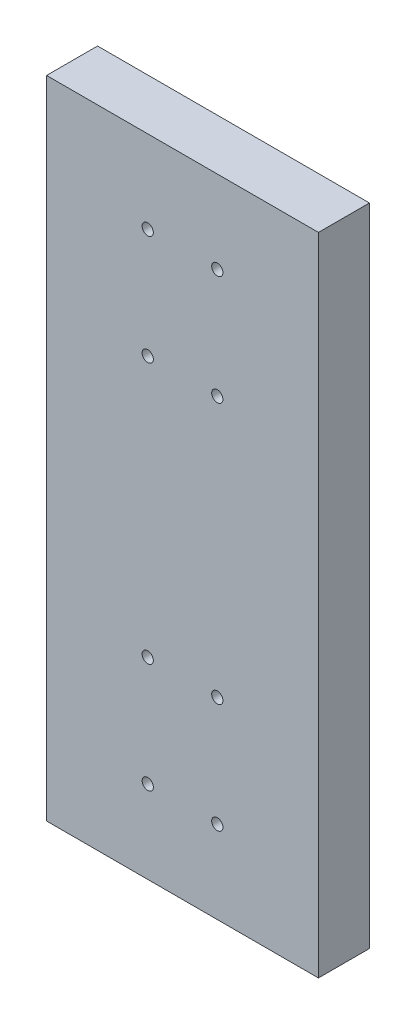
ISO-10303-21;
HEADER;
FILE_DESCRIPTION(('STEP AP214'),'2;1');
FILE_NAME('part.step','',(''),(''),'','','');
FILE_SCHEMA(('AUTOMOTIVE_DESIGN { 1 0 10303 214 1 1 1 1 }'));
ENDSEC;
DATA;
#1=APPLICATION_CONTEXT('core data for automotive mechanical design processes');
#2=APPLICATION_PROTOCOL_DEFINITION('international standard','automotive_design',2000,#1);
#3=PRODUCT_CONTEXT('',#1,'mechanical');
#4=PRODUCT('Part','Part','',(#3));
#5=PRODUCT_RELATED_PRODUCT_CATEGORY('part','',(#4));
#6=PRODUCT_DEFINITION_FORMATION('','',#4);
#7=PRODUCT_DEFINITION_CONTEXT('part definition',#1,'design');
#8=PRODUCT_DEFINITION('design','',#6,#7);
#9=PRODUCT_DEFINITION_SHAPE('','',#8);
#10=(LENGTH_UNIT() NAMED_UNIT(*) SI_UNIT(.MILLI.,.METRE.));
#11=(NAMED_UNIT(*) PLANE_ANGLE_UNIT() SI_UNIT($,.RADIAN.));
#12=(NAMED_UNIT(*) SI_UNIT($,.STERADIAN.) SOLID_ANGLE_UNIT());
#13=UNCERTAINTY_MEASURE_WITH_UNIT(LENGTH_MEASURE(1.E-05),#10,'distance_accuracy_value','');
#14=(GEOMETRIC_REPRESENTATION_CONTEXT(3) GLOBAL_UNCERTAINTY_ASSIGNED_CONTEXT((#13)) GLOBAL_UNIT_ASSIGNED_CONTEXT((#10,
#11,#12)) REPRESENTATION_CONTEXT('',''));
#15=CARTESIAN_POINT('',(0.,0.,0.));
#16=DIRECTION('',(0.,0.,1.));
#17=DIRECTION('',(1.,0.,0.));
#18=AXIS2_PLACEMENT_3D('',#15,#16,#17);
#19=CARTESIAN_POINT('',(-421.424489340462,4984.89555917853,19.0499999999997));
#20=DIRECTION('',(1.,0.,0.));
#21=DIRECTION('',(0.,1.,0.));
#22=AXIS2_PLACEMENT_3D('',#19,#20,#21);
#23=PLANE('',#22);
#24=DIRECTION('',(0.,-1.,0.));
#25=VECTOR('',#24,1.);
#26=CARTESIAN_POINT('',(-421.424489340462,4984.89555917853,-2.77555756156289E-13));
#27=LINE('',#26,#25);
#28=CARTESIAN_POINT('',(-421.424489340462,4984.89555917853,-2.77555756156289E-13));
#29=VERTEX_POINT('',#28);
#30=CARTESIAN_POINT('',(-421.424489340462,4743.59555917853,-2.77555756156289E-13));
#31=VERTEX_POINT('',#30);
#32=EDGE_CURVE('E167',#29,#31,#27,.T.);
#33=ORIENTED_EDGE('',*,*,#32,.T.);
#34=DIRECTION('',(0.,0.,-1.));
#35=VECTOR('',#34,1.);
#36=CARTESIAN_POINT('',(-421.424489340462,4743.59555917853,19.0499999999997));
#37=LINE('',#36,#35);
#38=CARTESIAN_POINT('',(-421.424489340462,4743.59555917853,19.0499999999997));
#39=VERTEX_POINT('',#38);
#40=EDGE_CURVE('E11',#39,#31,#37,.T.);
#41=ORIENTED_EDGE('',*,*,#40,.F.);
#42=DIRECTION('',(0.,-1.,0.));
#43=VECTOR('',#42,1.);
#44=CARTESIAN_POINT('',(-421.424489340462,4984.89555917853,19.0499999999997));
#45=LINE('',#44,#43);
#46=CARTESIAN_POINT('',(-421.424489340462,4984.89555917853,19.0499999999997));
#47=VERTEX_POINT('',#46);
#48=EDGE_CURVE('E168',#47,#39,#45,.T.);
#49=ORIENTED_EDGE('',*,*,#48,.F.);
#50=DIRECTION('',(0.,0.,-1.));
#51=VECTOR('',#50,1.);
#52=CARTESIAN_POINT('',(-421.424489340462,4984.89555917853,19.0499999999997));
#53=LINE('',#52,#51);
#54=EDGE_CURVE('E174',#47,#29,#53,.T.);
#55=ORIENTED_EDGE('',*,*,#54,.T.);
#56=EDGE_LOOP('',(#33,#41,#49,#55));
#57=FACE_BOUND('',#56,.T.);
#58=ADVANCED_FACE('F38',(#57),#23,.F.);
#59=CARTESIAN_POINT('',(-421.424489340462,4743.59555917853,19.0499999999997));
#60=DIRECTION('',(0.,1.,0.));
#61=DIRECTION('',(0.,0.,1.));
#62=AXIS2_PLACEMENT_3D('',#59,#60,#61);
#63=PLANE('',#62);
#64=DIRECTION('',(1.,0.,0.));
#65=VECTOR('',#64,1.);
#66=CARTESIAN_POINT('',(-421.424489340462,4743.59555917853,-2.77555756156289E-13));
#67=LINE('',#66,#65);
#68=CARTESIAN_POINT('',(-319.824489340462,4743.59555917853,-2.77555756156289E-13));
#69=VERTEX_POINT('',#68);
#70=EDGE_CURVE('E177',#31,#69,#67,.T.);
#71=ORIENTED_EDGE('',*,*,#70,.T.);
#72=DIRECTION('',(0.,0.,-1.));
#73=VECTOR('',#72,1.);
#74=CARTESIAN_POINT('',(-319.824489340462,4743.59555917853,19.0499999999997));
#75=LINE('',#74,#73);
#76=CARTESIAN_POINT('',(-319.824489340462,4743.59555917853,19.0499999999997));
#77=VERTEX_POINT('',#76);
#78=EDGE_CURVE('E46',#77,#69,#75,.T.);
#79=ORIENTED_EDGE('',*,*,#78,.F.);
#80=DIRECTION('',(1.,0.,0.));
#81=VECTOR('',#80,1.);
#82=CARTESIAN_POINT('',(-421.424489340462,4743.59555917853,19.0499999999997));
#83=LINE('',#82,#81);
#84=EDGE_CURVE('E85',#39,#77,#83,.T.);
#85=ORIENTED_EDGE('',*,*,#84,.F.);
#86=ORIENTED_EDGE('',*,*,#40,.T.);
#87=EDGE_LOOP('',(#71,#79,#85,#86));
#88=FACE_BOUND('',#87,.T.);
#89=ADVANCED_FACE('F201',(#88),#63,.F.);
#90=CARTESIAN_POINT('',(-319.824489340462,4984.89555917853,19.0499999999997));
#91=DIRECTION('',(-1.,0.,0.));
#92=DIRECTION('',(0.,0.,1.));
#93=AXIS2_PLACEMENT_3D('',#90,#91,#92);
#94=PLANE('',#93);
#95=DIRECTION('',(0.,1.,0.));
#96=VECTOR('',#95,1.);
#97=CARTESIAN_POINT('',(-319.824489340462,4984.89555917853,-2.77555756156289E-13));
#98=LINE('',#97,#96);
#99=CARTESIAN_POINT('',(-319.824489340462,4984.89555917853,-2.77555756156289E-13));
#100=VERTEX_POINT('',#99);
#101=EDGE_CURVE('E72',#69,#100,#98,.T.);
#102=ORIENTED_EDGE('',*,*,#101,.T.);
#103=DIRECTION('',(0.,0.,-1.));
#104=VECTOR('',#103,1.);
#105=CARTESIAN_POINT('',(-319.824489340462,4984.89555917853,19.0499999999997));
#106=LINE('',#105,#104);
#107=CARTESIAN_POINT('',(-319.824489340462,4984.89555917853,19.0499999999997));
#108=VERTEX_POINT('',#107);
#109=EDGE_CURVE('E182',#108,#100,#106,.T.);
#110=ORIENTED_EDGE('',*,*,#109,.F.);
#111=DIRECTION('',(0.,1.,0.));
#112=VECTOR('',#111,1.);
#113=CARTESIAN_POINT('',(-319.824489340462,4984.89555917853,19.0499999999997));
#114=LINE('',#113,#112);
#115=EDGE_CURVE('E171',#77,#108,#114,.T.);
#116=ORIENTED_EDGE('',*,*,#115,.F.);
#117=ORIENTED_EDGE('',*,*,#78,.T.);
#118=EDGE_LOOP('',(#102,#110,#116,#117));
#119=FACE_BOUND('',#118,.T.);
#120=ADVANCED_FACE('F184',(#119),#94,.F.);
#121=CARTESIAN_POINT('',(-421.424489340462,4984.89555917853,19.0499999999997));
#122=DIRECTION('',(0.,-1.,0.));
#123=DIRECTION('',(0.,0.,-1.));
#124=AXIS2_PLACEMENT_3D('',#121,#122,#123);
#125=PLANE('',#124);
#126=DIRECTION('',(-1.,0.,0.));
#127=VECTOR('',#126,1.);
#128=CARTESIAN_POINT('',(-421.424489340462,4984.89555917853,-2.77555756156289E-13));
#129=LINE('',#128,#127);
#130=EDGE_CURVE('E78',#100,#29,#129,.T.);
#131=ORIENTED_EDGE('',*,*,#130,.T.);
#132=ORIENTED_EDGE('',*,*,#54,.F.);
#133=DIRECTION('',(-1.,0.,0.));
#134=VECTOR('',#133,1.);
#135=CARTESIAN_POINT('',(-421.424489340462,4984.89555917853,19.0499999999997));
#136=LINE('',#135,#134);
#137=EDGE_CURVE('E54',#108,#47,#136,.T.);
#138=ORIENTED_EDGE('',*,*,#137,.F.);
#139=ORIENTED_EDGE('',*,*,#109,.T.);
#140=EDGE_LOOP('',(#131,#132,#138,#139));
#141=FACE_BOUND('',#140,.T.);
#142=ADVANCED_FACE('F191',(#141),#125,.F.);
#143=CARTESIAN_POINT('',(0.,0.,19.0499999999997));
#144=DIRECTION('',(0.,0.,1.));
#145=DIRECTION('',(1.,0.,0.));
#146=AXIS2_PLACEMENT_3D('',#143,#144,#145);
#147=PLANE('',#146);
#148=CARTESIAN_POINT('',(-383.624489340462,4912.99555917853,19.0499999999996));
#149=DIRECTION('',(0.,0.,1.));
#150=DIRECTION('',(0.,-1.,0.));
#151=AXIS2_PLACEMENT_3D('',#148,#149,#150);
#152=CIRCLE('',#151,2.09999999999999);
#153=CARTESIAN_POINT('',(-383.624489340462,4910.89555917853,19.0499999999996));
#154=VERTEX_POINT('',#153);
#155=EDGE_CURVE('E121',#154,#154,#152,.T.);
#156=ORIENTED_EDGE('',*,*,#155,.F.);
#157=EDGE_LOOP('',(#156));
#158=FACE_BOUND('',#157,.T.);
#159=CARTESIAN_POINT('',(-357.624489340539,4912.99555917853,19.0499999999996));
#160=DIRECTION('',(0.,0.,1.));
#161=DIRECTION('',(0.,-1.,0.));
#162=AXIS2_PLACEMENT_3D('',#159,#160,#161);
#163=CIRCLE('',#162,2.09999999999999);
#164=CARTESIAN_POINT('',(-357.624489340539,4910.89555917853,19.0499999999996));
#165=VERTEX_POINT('',#164);
#166=EDGE_CURVE('E120',#165,#165,#163,.T.);
#167=ORIENTED_EDGE('',*,*,#166,.F.);
#168=EDGE_LOOP('',(#167));
#169=FACE_BOUND('',#168,.T.);
#170=CARTESIAN_POINT('',(-357.624489340462,4953.99555917853,19.0499999999996));
#171=DIRECTION('',(0.,0.,1.));
#172=DIRECTION('',(0.,-1.,0.));
#173=AXIS2_PLACEMENT_3D('',#170,#171,#172);
#174=CIRCLE('',#173,2.09999999999999);
#175=CARTESIAN_POINT('',(-357.624489340462,4951.89555917853,19.0499999999996));
#176=VERTEX_POINT('',#175);
#177=EDGE_CURVE('E131',#176,#176,#174,.T.);
#178=ORIENTED_EDGE('',*,*,#177,.F.);
#179=EDGE_LOOP('',(#178));
#180=FACE_BOUND('',#179,.T.);
#181=CARTESIAN_POINT('',(-383.624489340462,4953.99555917853,19.0499999999996));
#182=DIRECTION('',(0.,0.,1.));
#183=DIRECTION('',(0.,-1.,0.));
#184=AXIS2_PLACEMENT_3D('',#181,#182,#183);
#185=CIRCLE('',#184,2.09999999999999);
#186=CARTESIAN_POINT('',(-383.624489340462,4951.89555917853,19.0499999999996));
#187=VERTEX_POINT('',#186);
#188=EDGE_CURVE('E137',#187,#187,#185,.T.);
#189=ORIENTED_EDGE('',*,*,#188,.F.);
#190=EDGE_LOOP('',(#189));
#191=FACE_BOUND('',#190,.T.);
#192=CARTESIAN_POINT('',(-383.62448934054,4774.49555917867,19.0499999999996));
#193=DIRECTION('',(0.,0.,1.));
#194=DIRECTION('',(0.,-1.,0.));
#195=AXIS2_PLACEMENT_3D('',#192,#193,#194);
#196=CIRCLE('',#195,2.09999999999999);
#197=CARTESIAN_POINT('',(-383.62448934054,4772.39555917867,19.0499999999996));
#198=VERTEX_POINT('',#197);
#199=EDGE_CURVE('E143',#198,#198,#196,.T.);
#200=ORIENTED_EDGE('',*,*,#199,.F.);
#201=EDGE_LOOP('',(#200));
#202=FACE_BOUND('',#201,.T.);
#203=CARTESIAN_POINT('',(-383.62448934054,4815.49555917868,19.0499999999996));
#204=DIRECTION('',(0.,0.,1.));
#205=DIRECTION('',(0.,-1.,0.));
#206=AXIS2_PLACEMENT_3D('',#203,#204,#205);
#207=CIRCLE('',#206,2.09999999999999);
#208=CARTESIAN_POINT('',(-383.62448934054,4813.39555917867,19.0499999999996));
#209=VERTEX_POINT('',#208);
#210=EDGE_CURVE('E149',#209,#209,#207,.T.);
#211=ORIENTED_EDGE('',*,*,#210,.F.);
#212=EDGE_LOOP('',(#211));
#213=FACE_BOUND('',#212,.T.);
#214=CARTESIAN_POINT('',(-357.62448934054,4815.49555917867,19.0499999999996));
#215=DIRECTION('',(0.,0.,1.));
#216=DIRECTION('',(0.,-1.,0.));
#217=AXIS2_PLACEMENT_3D('',#214,#215,#216);
#218=CIRCLE('',#217,2.09999999999999);
#219=CARTESIAN_POINT('',(-357.62448934054,4813.39555917867,19.0499999999996));
#220=VERTEX_POINT('',#219);
#221=EDGE_CURVE('E155',#220,#220,#218,.T.);
#222=ORIENTED_EDGE('',*,*,#221,.F.);
#223=EDGE_LOOP('',(#222));
#224=FACE_BOUND('',#223,.T.);
#225=CARTESIAN_POINT('',(-357.624489340462,4774.49555917863,19.0499999999996));
#226=DIRECTION('',(0.,0.,1.));
#227=DIRECTION('',(0.,-1.,0.));
#228=AXIS2_PLACEMENT_3D('',#225,#226,#227);
#229=CIRCLE('',#228,2.09999999999999);
#230=CARTESIAN_POINT('',(-357.624489340462,4772.39555917863,19.0499999999996));
#231=VERTEX_POINT('',#230);
#232=EDGE_CURVE('E161',#231,#231,#229,.T.);
#233=ORIENTED_EDGE('',*,*,#232,.F.);
#234=EDGE_LOOP('',(#233));
#235=FACE_BOUND('',#234,.T.);
#236=ORIENTED_EDGE('',*,*,#48,.T.);
#237=ORIENTED_EDGE('',*,*,#84,.T.);
#238=ORIENTED_EDGE('',*,*,#115,.T.);
#239=ORIENTED_EDGE('',*,*,#137,.T.);
#240=EDGE_LOOP('',(#236,#237,#238,#239));
#241=FACE_BOUND('',#240,.T.);
#242=ADVANCED_FACE('F193',(#158,#169,#180,#191,#202,#213,#224,#235,#241),#147,.T.);
#243=CARTESIAN_POINT('',(0.,0.,-2.77555756156289E-13));
#244=DIRECTION('',(0.,0.,1.));
#245=DIRECTION('',(1.,0.,0.));
#246=AXIS2_PLACEMENT_3D('',#243,#244,#245);
#247=PLANE('',#246);
#248=ORIENTED_EDGE('',*,*,#32,.F.);
#249=ORIENTED_EDGE('',*,*,#130,.F.);
#250=ORIENTED_EDGE('',*,*,#101,.F.);
#251=ORIENTED_EDGE('',*,*,#70,.F.);
#252=EDGE_LOOP('',(#248,#249,#250,#251));
#253=FACE_BOUND('',#252,.T.);
#254=ADVANCED_FACE('F187',(#253),#247,.F.);
#255=CARTESIAN_POINT('',(-357.624489340462,4774.49555917863,7.64999739999959));
#256=DIRECTION('',(0.,0.,1.));
#257=DIRECTION('',(0.,-1.,0.));
#258=AXIS2_PLACEMENT_3D('',#255,#256,#257);
#259=CONICAL_SURFACE('',#258,2.09999999999999,1.02974425867665);
#260=CARTESIAN_POINT('',(-357.624489340462,4774.49555917863,6.38819010004171));
#261=VERTEX_POINT('',#260);
#262=VERTEX_LOOP('',#261);
#263=FACE_BOUND('',#262,.T.);
#264=CARTESIAN_POINT('',(-357.624489340462,4774.49555917863,7.64999739999959));
#265=DIRECTION('',(0.,0.,1.));
#266=DIRECTION('',(0.,-1.,0.));
#267=AXIS2_PLACEMENT_3D('',#264,#265,#266);
#268=CIRCLE('',#267,2.09999999999999);
#269=CARTESIAN_POINT('',(-357.624489340462,4772.39555917863,7.64999739999959));
#270=VERTEX_POINT('',#269);
#271=EDGE_CURVE('E164',#270,#270,#268,.T.);
#272=ORIENTED_EDGE('',*,*,#271,.T.);
#273=EDGE_LOOP('',(#272));
#274=FACE_BOUND('',#273,.T.);
#275=ADVANCED_FACE('F228',(#263,#274),#259,.F.);
#276=CARTESIAN_POINT('',(-357.624489340462,4774.49555917863,19.0499999999996));
#277=DIRECTION('',(0.,0.,1.));
#278=DIRECTION('',(0.,-1.,0.));
#279=AXIS2_PLACEMENT_3D('',#276,#277,#278);
#280=CYLINDRICAL_SURFACE('',#279,2.09999999999999);
#281=ORIENTED_EDGE('',*,*,#271,.F.);
#282=EDGE_LOOP('',(#281));
#283=FACE_BOUND('',#282,.T.);
#284=ORIENTED_EDGE('',*,*,#232,.T.);
#285=EDGE_LOOP('',(#284));
#286=FACE_BOUND('',#285,.T.);
#287=ADVANCED_FACE('F241',(#283,#286),#280,.F.);
#288=CARTESIAN_POINT('',(-357.62448934054,4815.49555917867,7.64999739999959));
#289=DIRECTION('',(0.,0.,1.));
#290=DIRECTION('',(0.,-1.,0.));
#291=AXIS2_PLACEMENT_3D('',#288,#289,#290);
#292=CONICAL_SURFACE('',#291,2.09999999999999,1.02974425867665);
#293=CARTESIAN_POINT('',(-357.62448934054,4815.49555917867,6.38819010004171));
#294=VERTEX_POINT('',#293);
#295=VERTEX_LOOP('',#294);
#296=FACE_BOUND('',#295,.T.);
#297=CARTESIAN_POINT('',(-357.62448934054,4815.49555917867,7.64999739999959));
#298=DIRECTION('',(0.,0.,1.));
#299=DIRECTION('',(0.,-1.,0.));
#300=AXIS2_PLACEMENT_3D('',#297,#298,#299);
#301=CIRCLE('',#300,2.09999999999999);
#302=CARTESIAN_POINT('',(-357.62448934054,4813.39555917867,7.64999739999959));
#303=VERTEX_POINT('',#302);
#304=EDGE_CURVE('E158',#303,#303,#301,.T.);
#305=ORIENTED_EDGE('',*,*,#304,.T.);
#306=EDGE_LOOP('',(#305));
#307=FACE_BOUND('',#306,.T.);
#308=ADVANCED_FACE('F251',(#296,#307),#292,.F.);
#309=CARTESIAN_POINT('',(-357.62448934054,4815.49555917867,19.0499999999996));
#310=DIRECTION('',(0.,0.,1.));
#311=DIRECTION('',(0.,-1.,0.));
#312=AXIS2_PLACEMENT_3D('',#309,#310,#311);
#313=CYLINDRICAL_SURFACE('',#312,2.09999999999999);
#314=ORIENTED_EDGE('',*,*,#304,.F.);
#315=EDGE_LOOP('',(#314));
#316=FACE_BOUND('',#315,.T.);
#317=ORIENTED_EDGE('',*,*,#221,.T.);
#318=EDGE_LOOP('',(#317));
#319=FACE_BOUND('',#318,.T.);
#320=ADVANCED_FACE('F261',(#316,#319),#313,.F.);
#321=CARTESIAN_POINT('',(-383.62448934054,4815.49555917868,7.64999739999959));
#322=DIRECTION('',(0.,0.,1.));
#323=DIRECTION('',(0.,-1.,0.));
#324=AXIS2_PLACEMENT_3D('',#321,#322,#323);
#325=CONICAL_SURFACE('',#324,2.09999999999999,1.02974425867665);
#326=CARTESIAN_POINT('',(-383.62448934054,4815.49555917868,6.38819010004171));
#327=VERTEX_POINT('',#326);
#328=VERTEX_LOOP('',#327);
#329=FACE_BOUND('',#328,.T.);
#330=CARTESIAN_POINT('',(-383.62448934054,4815.49555917868,7.64999739999959));
#331=DIRECTION('',(0.,0.,1.));
#332=DIRECTION('',(0.,-1.,0.));
#333=AXIS2_PLACEMENT_3D('',#330,#331,#332);
#334=CIRCLE('',#333,2.09999999999999);
#335=CARTESIAN_POINT('',(-383.62448934054,4813.39555917867,7.64999739999959));
#336=VERTEX_POINT('',#335);
#337=EDGE_CURVE('E152',#336,#336,#334,.T.);
#338=ORIENTED_EDGE('',*,*,#337,.T.);
#339=EDGE_LOOP('',(#338));
#340=FACE_BOUND('',#339,.T.);
#341=ADVANCED_FACE('F271',(#329,#340),#325,.F.);
#342=CARTESIAN_POINT('',(-383.62448934054,4815.49555917868,19.0499999999996));
#343=DIRECTION('',(0.,0.,1.));
#344=DIRECTION('',(0.,-1.,0.));
#345=AXIS2_PLACEMENT_3D('',#342,#343,#344);
#346=CYLINDRICAL_SURFACE('',#345,2.09999999999999);
#347=ORIENTED_EDGE('',*,*,#337,.F.);
#348=EDGE_LOOP('',(#347));
#349=FACE_BOUND('',#348,.T.);
#350=ORIENTED_EDGE('',*,*,#210,.T.);
#351=EDGE_LOOP('',(#350));
#352=FACE_BOUND('',#351,.T.);
#353=ADVANCED_FACE('F281',(#349,#352),#346,.F.);
#354=CARTESIAN_POINT('',(-383.62448934054,4774.49555917867,7.64999739999959));
#355=DIRECTION('',(0.,0.,1.));
#356=DIRECTION('',(0.,-1.,0.));
#357=AXIS2_PLACEMENT_3D('',#354,#355,#356);
#358=CONICAL_SURFACE('',#357,2.09999999999999,1.02974425867665);
#359=CARTESIAN_POINT('',(-383.62448934054,4774.49555917867,6.38819010004171));
#360=VERTEX_POINT('',#359);
#361=VERTEX_LOOP('',#360);
#362=FACE_BOUND('',#361,.T.);
#363=CARTESIAN_POINT('',(-383.62448934054,4774.49555917867,7.64999739999959));
#364=DIRECTION('',(0.,0.,1.));
#365=DIRECTION('',(0.,-1.,0.));
#366=AXIS2_PLACEMENT_3D('',#363,#364,#365);
#367=CIRCLE('',#366,2.09999999999999);
#368=CARTESIAN_POINT('',(-383.62448934054,4772.39555917867,7.64999739999959));
#369=VERTEX_POINT('',#368);
#370=EDGE_CURVE('E146',#369,#369,#367,.T.);
#371=ORIENTED_EDGE('',*,*,#370,.T.);
#372=EDGE_LOOP('',(#371));
#373=FACE_BOUND('',#372,.T.);
#374=ADVANCED_FACE('F291',(#362,#373),#358,.F.);
#375=CARTESIAN_POINT('',(-383.62448934054,4774.49555917867,19.0499999999996));
#376=DIRECTION('',(0.,0.,1.));
#377=DIRECTION('',(0.,-1.,0.));
#378=AXIS2_PLACEMENT_3D('',#375,#376,#377);
#379=CYLINDRICAL_SURFACE('',#378,2.09999999999999);
#380=ORIENTED_EDGE('',*,*,#370,.F.);
#381=EDGE_LOOP('',(#380));
#382=FACE_BOUND('',#381,.T.);
#383=ORIENTED_EDGE('',*,*,#199,.T.);
#384=EDGE_LOOP('',(#383));
#385=FACE_BOUND('',#384,.T.);
#386=ADVANCED_FACE('F301',(#382,#385),#379,.F.);
#387=CARTESIAN_POINT('',(-383.624489340462,4953.99555917853,7.64999739999958));
#388=DIRECTION('',(0.,0.,1.));
#389=DIRECTION('',(0.,-1.,0.));
#390=AXIS2_PLACEMENT_3D('',#387,#388,#389);
#391=CONICAL_SURFACE('',#390,2.09999999999999,1.02974425867665);
#392=CARTESIAN_POINT('',(-383.624489340462,4953.99555917853,6.38819010004171));
#393=VERTEX_POINT('',#392);
#394=VERTEX_LOOP('',#393);
#395=FACE_BOUND('',#394,.T.);
#396=CARTESIAN_POINT('',(-383.624489340462,4953.99555917853,7.64999739999958));
#397=DIRECTION('',(0.,0.,1.));
#398=DIRECTION('',(0.,-1.,0.));
#399=AXIS2_PLACEMENT_3D('',#396,#397,#398);
#400=CIRCLE('',#399,2.09999999999999);
#401=CARTESIAN_POINT('',(-383.624489340462,4951.89555917853,7.64999739999958));
#402=VERTEX_POINT('',#401);
#403=EDGE_CURVE('E140',#402,#402,#400,.T.);
#404=ORIENTED_EDGE('',*,*,#403,.T.);
#405=EDGE_LOOP('',(#404));
#406=FACE_BOUND('',#405,.T.);
#407=ADVANCED_FACE('F311',(#395,#406),#391,.F.);
#408=CARTESIAN_POINT('',(-383.624489340462,4953.99555917853,19.0499999999996));
#409=DIRECTION('',(0.,0.,1.));
#410=DIRECTION('',(0.,-1.,0.));
#411=AXIS2_PLACEMENT_3D('',#408,#409,#410);
#412=CYLINDRICAL_SURFACE('',#411,2.09999999999999);
#413=ORIENTED_EDGE('',*,*,#403,.F.);
#414=EDGE_LOOP('',(#413));
#415=FACE_BOUND('',#414,.T.);
#416=ORIENTED_EDGE('',*,*,#188,.T.);
#417=EDGE_LOOP('',(#416));
#418=FACE_BOUND('',#417,.T.);
#419=ADVANCED_FACE('F321',(#415,#418),#412,.F.);
#420=CARTESIAN_POINT('',(-357.624489340462,4953.99555917853,7.64999739999958));
#421=DIRECTION('',(0.,0.,1.));
#422=DIRECTION('',(0.,-1.,0.));
#423=AXIS2_PLACEMENT_3D('',#420,#421,#422);
#424=CONICAL_SURFACE('',#423,2.09999999999999,1.02974425867665);
#425=CARTESIAN_POINT('',(-357.624489340462,4953.99555917853,6.38819010004171));
#426=VERTEX_POINT('',#425);
#427=VERTEX_LOOP('',#426);
#428=FACE_BOUND('',#427,.T.);
#429=CARTESIAN_POINT('',(-357.624489340462,4953.99555917853,7.64999739999958));
#430=DIRECTION('',(0.,0.,1.));
#431=DIRECTION('',(0.,-1.,0.));
#432=AXIS2_PLACEMENT_3D('',#429,#430,#431);
#433=CIRCLE('',#432,2.09999999999999);
#434=CARTESIAN_POINT('',(-357.624489340462,4951.89555917853,7.64999739999958));
#435=VERTEX_POINT('',#434);
#436=EDGE_CURVE('E134',#435,#435,#433,.T.);
#437=ORIENTED_EDGE('',*,*,#436,.T.);
#438=EDGE_LOOP('',(#437));
#439=FACE_BOUND('',#438,.T.);
#440=ADVANCED_FACE('F331',(#428,#439),#424,.F.);
#441=CARTESIAN_POINT('',(-357.624489340462,4953.99555917853,19.0499999999996));
#442=DIRECTION('',(0.,0.,1.));
#443=DIRECTION('',(0.,-1.,0.));
#444=AXIS2_PLACEMENT_3D('',#441,#442,#443);
#445=CYLINDRICAL_SURFACE('',#444,2.09999999999999);
#446=ORIENTED_EDGE('',*,*,#436,.F.);
#447=EDGE_LOOP('',(#446));
#448=FACE_BOUND('',#447,.T.);
#449=ORIENTED_EDGE('',*,*,#177,.T.);
#450=EDGE_LOOP('',(#449));
#451=FACE_BOUND('',#450,.T.);
#452=ADVANCED_FACE('F341',(#448,#451),#445,.F.);
#453=CARTESIAN_POINT('',(-357.624489340539,4912.99555917853,7.64999739999959));
#454=DIRECTION('',(0.,0.,1.));
#455=DIRECTION('',(0.,-1.,0.));
#456=AXIS2_PLACEMENT_3D('',#453,#454,#455);
#457=CONICAL_SURFACE('',#456,2.09999999999999,1.02974425867665);
#458=CARTESIAN_POINT('',(-357.624489340539,4912.99555917853,6.38819010004171));
#459=VERTEX_POINT('',#458);
#460=VERTEX_LOOP('',#459);
#461=FACE_BOUND('',#460,.T.);
#462=CARTESIAN_POINT('',(-357.624489340539,4912.99555917853,7.64999739999959));
#463=DIRECTION('',(0.,0.,1.));
#464=DIRECTION('',(0.,-1.,0.));
#465=AXIS2_PLACEMENT_3D('',#462,#463,#464);
#466=CIRCLE('',#465,2.09999999999999);
#467=CARTESIAN_POINT('',(-357.624489340539,4910.89555917853,7.64999739999959));
#468=VERTEX_POINT('',#467);
#469=EDGE_CURVE('E124',#468,#468,#466,.T.);
#470=ORIENTED_EDGE('',*,*,#469,.T.);
#471=EDGE_LOOP('',(#470));
#472=FACE_BOUND('',#471,.T.);
#473=ADVANCED_FACE('F351',(#461,#472),#457,.F.);
#474=CARTESIAN_POINT('',(-357.624489340539,4912.99555917853,19.0499999999996));
#475=DIRECTION('',(0.,0.,1.));
#476=DIRECTION('',(0.,-1.,0.));
#477=AXIS2_PLACEMENT_3D('',#474,#475,#476);
#478=CYLINDRICAL_SURFACE('',#477,2.09999999999999);
#479=ORIENTED_EDGE('',*,*,#469,.F.);
#480=EDGE_LOOP('',(#479));
#481=FACE_BOUND('',#480,.T.);
#482=ORIENTED_EDGE('',*,*,#166,.T.);
#483=EDGE_LOOP('',(#482));
#484=FACE_BOUND('',#483,.T.);
#485=ADVANCED_FACE('F114',(#481,#484),#478,.F.);
#486=CARTESIAN_POINT('',(-383.624489340462,4912.99555917853,7.64999739999959));
#487=DIRECTION('',(0.,0.,1.));
#488=DIRECTION('',(0.,-1.,0.));
#489=AXIS2_PLACEMENT_3D('',#486,#487,#488);
#490=CONICAL_SURFACE('',#489,2.09999999999999,1.02974425867665);
#491=CARTESIAN_POINT('',(-383.624489340462,4912.99555917853,6.38819010004171));
#492=VERTEX_POINT('',#491);
#493=VERTEX_LOOP('',#492);
#494=FACE_BOUND('',#493,.T.);
#495=CARTESIAN_POINT('',(-383.624489340462,4912.99555917853,7.64999739999959));
#496=DIRECTION('',(0.,0.,1.));
#497=DIRECTION('',(0.,-1.,0.));
#498=AXIS2_PLACEMENT_3D('',#495,#496,#497);
#499=CIRCLE('',#498,2.09999999999999);
#500=CARTESIAN_POINT('',(-383.624489340462,4910.89555917853,7.64999739999959));
#501=VERTEX_POINT('',#500);
#502=EDGE_CURVE('E118',#501,#501,#499,.T.);
#503=ORIENTED_EDGE('',*,*,#502,.T.);
#504=EDGE_LOOP('',(#503));
#505=FACE_BOUND('',#504,.T.);
#506=ADVANCED_FACE('F110',(#494,#505),#490,.F.);
#507=CARTESIAN_POINT('',(-383.624489340462,4912.99555917853,19.0499999999996));
#508=DIRECTION('',(0.,0.,1.));
#509=DIRECTION('',(0.,-1.,0.));
#510=AXIS2_PLACEMENT_3D('',#507,#508,#509);
#511=CYLINDRICAL_SURFACE('',#510,2.09999999999999);
#512=ORIENTED_EDGE('',*,*,#502,.F.);
#513=EDGE_LOOP('',(#512));
#514=FACE_BOUND('',#513,.T.);
#515=ORIENTED_EDGE('',*,*,#155,.T.);
#516=EDGE_LOOP('',(#515));
#517=FACE_BOUND('',#516,.T.);
#518=ADVANCED_FACE('F113',(#514,#517),#511,.F.);
#519=CLOSED_SHELL('',(#58,#89,#120,#142,#242,#254,#275,#287,#308,#320,#341,#353,#374,#386,#407,
#419,#440,#452,#473,#485,#506,#518));
#520=MANIFOLD_SOLID_BREP('B2',#519);
#521=ADVANCED_BREP_SHAPE_REPRESENTATION('',(#18,#520),#14);
#522=SHAPE_DEFINITION_REPRESENTATION(#9,#521);
ENDSEC;
END-ISO-10303-21;
